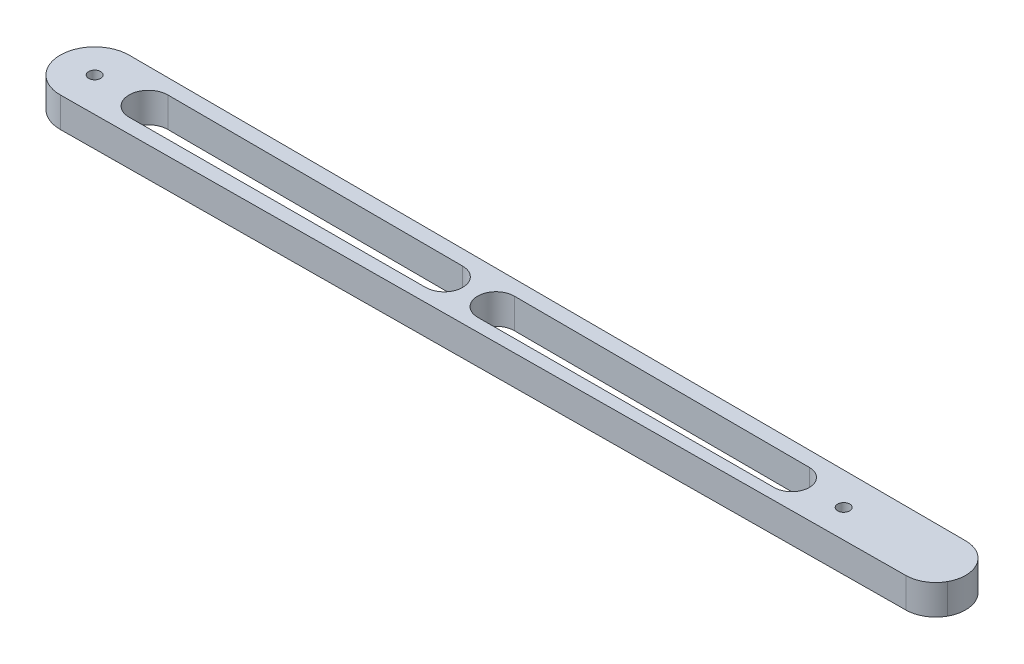
ISO-10303-21;
HEADER;
FILE_DESCRIPTION(('STEP AP214'),'2;1');
FILE_NAME('part.step','',(''),(''),'','','');
FILE_SCHEMA(('AUTOMOTIVE_DESIGN { 1 0 10303 214 1 1 1 1 }'));
ENDSEC;
DATA;
#1=APPLICATION_CONTEXT('core data for automotive mechanical design processes');
#2=APPLICATION_PROTOCOL_DEFINITION('international standard','automotive_design',2000,#1);
#3=PRODUCT_CONTEXT('',#1,'mechanical');
#4=PRODUCT('Part','Part','',(#3));
#5=PRODUCT_RELATED_PRODUCT_CATEGORY('part','',(#4));
#6=PRODUCT_DEFINITION_FORMATION('','',#4);
#7=PRODUCT_DEFINITION_CONTEXT('part definition',#1,'design');
#8=PRODUCT_DEFINITION('design','',#6,#7);
#9=PRODUCT_DEFINITION_SHAPE('','',#8);
#10=(LENGTH_UNIT() NAMED_UNIT(*) SI_UNIT(.MILLI.,.METRE.));
#11=(NAMED_UNIT(*) PLANE_ANGLE_UNIT() SI_UNIT($,.RADIAN.));
#12=(NAMED_UNIT(*) SI_UNIT($,.STERADIAN.) SOLID_ANGLE_UNIT());
#13=UNCERTAINTY_MEASURE_WITH_UNIT(LENGTH_MEASURE(1.E-05),#10,'distance_accuracy_value','');
#14=(GEOMETRIC_REPRESENTATION_CONTEXT(3) GLOBAL_UNCERTAINTY_ASSIGNED_CONTEXT((#13)) GLOBAL_UNIT_ASSIGNED_CONTEXT((#10,
#11,#12)) REPRESENTATION_CONTEXT('',''));
#15=CARTESIAN_POINT('',(0.,0.,0.));
#16=DIRECTION('',(0.,0.,1.));
#17=DIRECTION('',(1.,0.,0.));
#18=AXIS2_PLACEMENT_3D('',#15,#16,#17);
#19=CARTESIAN_POINT('',(279.991516646627,10.,-0.713392763578785));
#20=DIRECTION('',(0.,-1.,0.));
#21=DIRECTION('',(0.,0.,-1.));
#22=AXIS2_PLACEMENT_3D('',#19,#20,#21);
#23=CYLINDRICAL_SURFACE('',#22,10.);
#24=DIRECTION('',(0.,-1.,0.));
#25=VECTOR('',#24,1.);
#26=CARTESIAN_POINT('',(288.751175374613,10.,4.11033805076096));
#27=LINE('',#26,#25);
#28=CARTESIAN_POINT('',(288.751175374613,10.,4.11033805076096));
#29=VERTEX_POINT('',#28);
#30=CARTESIAN_POINT('',(288.751175374613,0.,4.11033805076096));
#31=VERTEX_POINT('',#30);
#32=EDGE_CURVE('E11',#29,#31,#27,.T.);
#33=ORIENTED_EDGE('',*,*,#32,.F.);
#34=CARTESIAN_POINT('',(279.991516646627,10.,-0.713392763578785));
#35=DIRECTION('',(0.,1.,0.));
#36=DIRECTION('',(0.,0.,1.));
#37=AXIS2_PLACEMENT_3D('',#34,#35,#36);
#38=CIRCLE('',#37,10.);
#39=CARTESIAN_POINT('',(280.070567987159,10.,9.28629477581763));
#40=VERTEX_POINT('',#39);
#41=EDGE_CURVE('E224',#40,#29,#38,.T.);
#42=ORIENTED_EDGE('',*,*,#41,.F.);
#43=DIRECTION('',(0.,-1.,0.));
#44=VECTOR('',#43,1.);
#45=CARTESIAN_POINT('',(280.070567987159,10.,9.28629477581763));
#46=LINE('',#45,#44);
#47=CARTESIAN_POINT('',(280.070567987159,0.,9.28629477581763));
#48=VERTEX_POINT('',#47);
#49=EDGE_CURVE('E243',#40,#48,#46,.T.);
#50=ORIENTED_EDGE('',*,*,#49,.T.);
#51=CARTESIAN_POINT('',(279.991516646627,0.,-0.713392763578785));
#52=DIRECTION('',(0.,1.,0.));
#53=DIRECTION('',(0.,0.,1.));
#54=AXIS2_PLACEMENT_3D('',#51,#52,#53);
#55=CIRCLE('',#54,10.);
#56=EDGE_CURVE('E235',#48,#31,#55,.T.);
#57=ORIENTED_EDGE('',*,*,#56,.T.);
#58=EDGE_LOOP('',(#33,#42,#50,#57));
#59=FACE_BOUND('',#58,.T.);
#60=ADVANCED_FACE('F36',(#59),#23,.T.);
#61=CARTESIAN_POINT('',(0.,10.,0.));
#62=DIRECTION('',(0.,1.,0.));
#63=DIRECTION('',(0.,0.,1.));
#64=AXIS2_PLACEMENT_3D('',#61,#62,#63);
#65=PLANE('',#64);
#66=CARTESIAN_POINT('',(116.65361864242,10.,0.));
#67=DIRECTION('',(0.,1.,0.));
#68=DIRECTION('',(0.,0.,1.));
#69=AXIS2_PLACEMENT_3D('',#66,#67,#68);
#70=CIRCLE('',#69,6.17227253848298);
#71=CARTESIAN_POINT('',(116.670959066441,10.,6.17224818028293));
#72=VERTEX_POINT('',#71);
#73=CARTESIAN_POINT('',(116.670959066441,10.,-6.17224818028293));
#74=VERTEX_POINT('',#73);
#75=EDGE_CURVE('E136',#72,#74,#70,.T.);
#76=ORIENTED_EDGE('',*,*,#75,.F.);
#77=DIRECTION('',(0.99999605360912,0.,-0.00280940673192141));
#78=VECTOR('',#77,1.);
#79=CARTESIAN_POINT('',(17.9676918225829,10.,6.44954689806959));
#80=LINE('',#79,#78);
#81=CARTESIAN_POINT('',(17.9676918225829,10.,6.44954689806959));
#82=VERTEX_POINT('',#81);
#83=EDGE_CURVE('E154',#82,#72,#80,.T.);
#84=ORIENTED_EDGE('',*,*,#83,.F.);
#85=CARTESIAN_POINT('',(17.9495723506031,10.,0.));
#86=DIRECTION('',(0.,1.,0.));
#87=DIRECTION('',(0.,0.,1.));
#88=AXIS2_PLACEMENT_3D('',#85,#86,#87);
#89=CIRCLE('',#88,6.4495723506031);
#90=CARTESIAN_POINT('',(17.9676918225829,10.,-6.44954689806959));
#91=VERTEX_POINT('',#90);
#92=EDGE_CURVE('E157',#91,#82,#89,.T.);
#93=ORIENTED_EDGE('',*,*,#92,.F.);
#94=DIRECTION('',(-0.99999605360912,0.,-0.00280940673192141));
#95=VECTOR('',#94,1.);
#96=CARTESIAN_POINT('',(17.9676918225829,10.,-6.44954689806959));
#97=LINE('',#96,#95);
#98=EDGE_CURVE('E163',#74,#91,#97,.T.);
#99=ORIENTED_EDGE('',*,*,#98,.F.);
#100=EDGE_LOOP('',(#76,#84,#93,#99));
#101=FACE_BOUND('',#100,.T.);
#102=CARTESIAN_POINT('',(133.949572350603,10.,0.));
#103=DIRECTION('',(0.,1.,0.));
#104=DIRECTION('',(0.,0.,1.));
#105=AXIS2_PLACEMENT_3D('',#102,#103,#104);
#106=CIRCLE('',#105,6.12368116970022);
#107=CARTESIAN_POINT('',(133.966776261705,10.,-6.1236570032607));
#108=VERTEX_POINT('',#107);
#109=CARTESIAN_POINT('',(133.966776261705,10.,6.1236570032607));
#110=VERTEX_POINT('',#109);
#111=EDGE_CURVE('E188',#108,#110,#106,.T.);
#112=ORIENTED_EDGE('',*,*,#111,.F.);
#113=DIRECTION('',(-0.99999605360912,0.,-0.00280940673192142));
#114=VECTOR('',#113,1.);
#115=CARTESIAN_POINT('',(133.966776261705,10.,-6.1236570032607));
#116=LINE('',#115,#114);
#117=CARTESIAN_POINT('',(232.670043505563,10.,-5.84635828547403));
#118=VERTEX_POINT('',#117);
#119=EDGE_CURVE('E178',#118,#108,#116,.T.);
#120=ORIENTED_EDGE('',*,*,#119,.F.);
#121=CARTESIAN_POINT('',(232.65361864242,10.,0.));
#122=DIRECTION('',(0.,1.,0.));
#123=DIRECTION('',(0.,0.,1.));
#124=AXIS2_PLACEMENT_3D('',#121,#122,#123);
#125=CIRCLE('',#124,5.8463813575801);
#126=CARTESIAN_POINT('',(232.670043505563,10.,5.84635828547403));
#127=VERTEX_POINT('',#126);
#128=EDGE_CURVE('E193',#127,#118,#125,.T.);
#129=ORIENTED_EDGE('',*,*,#128,.F.);
#130=DIRECTION('',(0.99999605360912,0.,-0.00280940673192142));
#131=VECTOR('',#130,1.);
#132=CARTESIAN_POINT('',(133.966776261705,10.,6.1236570032607));
#133=LINE('',#132,#131);
#134=EDGE_CURVE('E190',#110,#127,#133,.T.);
#135=ORIENTED_EDGE('',*,*,#134,.F.);
#136=EDGE_LOOP('',(#112,#120,#129,#135));
#137=FACE_BOUND('',#136,.T.);
#138=CARTESIAN_POINT('',(250.,10.,0.));
#139=DIRECTION('',(0.,1.,0.));
#140=DIRECTION('',(0.,0.,1.));
#141=AXIS2_PLACEMENT_3D('',#138,#139,#140);
#142=CIRCLE('',#141,2.);
#143=CARTESIAN_POINT('',(250.,10.,2.));
#144=VERTEX_POINT('',#143);
#145=EDGE_CURVE('E211',#144,#144,#142,.T.);
#146=ORIENTED_EDGE('',*,*,#145,.F.);
#147=EDGE_LOOP('',(#146));
#148=FACE_BOUND('',#147,.T.);
#149=CARTESIAN_POINT('',(0.,10.,0.));
#150=DIRECTION('',(0.,1.,0.));
#151=DIRECTION('',(0.,0.,1.));
#152=AXIS2_PLACEMENT_3D('',#149,#150,#151);
#153=CIRCLE('',#152,11.5);
#154=CARTESIAN_POINT('',(0.032308177417096,10.,-11.4999546165049));
#155=VERTEX_POINT('',#154);
#156=CARTESIAN_POINT('',(0.0909090416124194,10.,11.4996406703059));
#157=VERTEX_POINT('',#156);
#158=EDGE_CURVE('E217',#155,#157,#153,.T.);
#159=ORIENTED_EDGE('',*,*,#158,.T.);
#160=DIRECTION('',(0.999968753939642,0.,-0.00790513405325384));
#161=VECTOR('',#160,1.);
#162=CARTESIAN_POINT('',(0.0909090416124194,10.,11.4996406703059));
#163=LINE('',#162,#161);
#164=EDGE_CURVE('E220',#157,#40,#163,.T.);
#165=ORIENTED_EDGE('',*,*,#164,.T.);
#166=ORIENTED_EDGE('',*,*,#41,.T.);
#167=CARTESIAN_POINT('',(280.019610713946,10.,-10.71335329967));
#168=VERTEX_POINT('',#167);
#169=EDGE_CURVE('E223',#29,#168,#38,.T.);
#170=ORIENTED_EDGE('',*,*,#169,.T.);
#171=DIRECTION('',(-0.99999605360912,0.,-0.00280940673192137));
#172=VECTOR('',#171,1.);
#173=CARTESIAN_POINT('',(280.019610713946,10.,-10.71335329967));
#174=LINE('',#173,#172);
#175=EDGE_CURVE('E227',#168,#155,#174,.T.);
#176=ORIENTED_EDGE('',*,*,#175,.T.);
#177=EDGE_LOOP('',(#159,#165,#166,#170,#176));
#178=FACE_BOUND('',#177,.T.);
#179=CARTESIAN_POINT('',(0.,10.,0.));
#180=DIRECTION('',(0.,1.,0.));
#181=DIRECTION('',(0.,0.,1.));
#182=AXIS2_PLACEMENT_3D('',#179,#180,#181);
#183=CIRCLE('',#182,2.);
#184=CARTESIAN_POINT('',(0.,10.,2.));
#185=VERTEX_POINT('',#184);
#186=EDGE_CURVE('E205',#185,#185,#183,.T.);
#187=ORIENTED_EDGE('',*,*,#186,.F.);
#188=EDGE_LOOP('',(#187));
#189=FACE_BOUND('',#188,.T.);
#190=ADVANCED_FACE('F259',(#101,#137,#148,#178,#189),#65,.T.);
#191=CARTESIAN_POINT('',(0.,0.,0.));
#192=DIRECTION('',(0.,1.,0.));
#193=DIRECTION('',(0.,0.,1.));
#194=AXIS2_PLACEMENT_3D('',#191,#192,#193);
#195=PLANE('',#194);
#196=DIRECTION('',(0.99999605360912,0.,-0.00280940673192141));
#197=VECTOR('',#196,1.);
#198=CARTESIAN_POINT('',(17.9676918225829,0.,6.44954689806959));
#199=LINE('',#198,#197);
#200=CARTESIAN_POINT('',(17.9676918225829,0.,6.44954689806959));
#201=VERTEX_POINT('',#200);
#202=CARTESIAN_POINT('',(116.670959066441,0.,6.17224818028293));
#203=VERTEX_POINT('',#202);
#204=EDGE_CURVE('E141',#201,#203,#199,.T.);
#205=ORIENTED_EDGE('',*,*,#204,.T.);
#206=CARTESIAN_POINT('',(116.65361864242,0.,0.));
#207=DIRECTION('',(0.,1.,0.));
#208=DIRECTION('',(0.,0.,1.));
#209=AXIS2_PLACEMENT_3D('',#206,#207,#208);
#210=CIRCLE('',#209,6.17227253848298);
#211=CARTESIAN_POINT('',(116.670959066441,0.,-6.17224818028293));
#212=VERTEX_POINT('',#211);
#213=EDGE_CURVE('E133',#203,#212,#210,.T.);
#214=ORIENTED_EDGE('',*,*,#213,.T.);
#215=DIRECTION('',(-0.99999605360912,0.,-0.00280940673192141));
#216=VECTOR('',#215,1.);
#217=CARTESIAN_POINT('',(17.9676918225829,0.,-6.44954689806959));
#218=LINE('',#217,#216);
#219=CARTESIAN_POINT('',(17.9676918225829,0.,-6.44954689806959));
#220=VERTEX_POINT('',#219);
#221=EDGE_CURVE('E145',#212,#220,#218,.T.);
#222=ORIENTED_EDGE('',*,*,#221,.T.);
#223=CARTESIAN_POINT('',(17.9495723506031,0.,0.));
#224=DIRECTION('',(0.,1.,0.));
#225=DIRECTION('',(0.,0.,1.));
#226=AXIS2_PLACEMENT_3D('',#223,#224,#225);
#227=CIRCLE('',#226,6.4495723506031);
#228=EDGE_CURVE('E149',#220,#201,#227,.T.);
#229=ORIENTED_EDGE('',*,*,#228,.T.);
#230=EDGE_LOOP('',(#205,#214,#222,#229));
#231=FACE_BOUND('',#230,.T.);
#232=DIRECTION('',(-0.99999605360912,0.,-0.00280940673192142));
#233=VECTOR('',#232,1.);
#234=CARTESIAN_POINT('',(133.966776261705,0.,-6.1236570032607));
#235=LINE('',#234,#233);
#236=CARTESIAN_POINT('',(232.670043505563,0.,-5.84635828547403));
#237=VERTEX_POINT('',#236);
#238=CARTESIAN_POINT('',(133.966776261705,0.,-6.1236570032607));
#239=VERTEX_POINT('',#238);
#240=EDGE_CURVE('E184',#237,#239,#235,.T.);
#241=ORIENTED_EDGE('',*,*,#240,.T.);
#242=CARTESIAN_POINT('',(133.949572350603,0.,0.));
#243=DIRECTION('',(0.,1.,0.));
#244=DIRECTION('',(0.,0.,1.));
#245=AXIS2_PLACEMENT_3D('',#242,#243,#244);
#246=CIRCLE('',#245,6.12368116970022);
#247=CARTESIAN_POINT('',(133.966776261705,0.,6.1236570032607));
#248=VERTEX_POINT('',#247);
#249=EDGE_CURVE('E174',#239,#248,#246,.T.);
#250=ORIENTED_EDGE('',*,*,#249,.T.);
#251=DIRECTION('',(0.99999605360912,0.,-0.00280940673192142));
#252=VECTOR('',#251,1.);
#253=CARTESIAN_POINT('',(133.966776261705,0.,6.1236570032607));
#254=LINE('',#253,#252);
#255=CARTESIAN_POINT('',(232.670043505563,0.,5.84635828547403));
#256=VERTEX_POINT('',#255);
#257=EDGE_CURVE('E177',#248,#256,#254,.T.);
#258=ORIENTED_EDGE('',*,*,#257,.T.);
#259=CARTESIAN_POINT('',(232.65361864242,0.,0.));
#260=DIRECTION('',(0.,1.,0.));
#261=DIRECTION('',(0.,0.,1.));
#262=AXIS2_PLACEMENT_3D('',#259,#260,#261);
#263=CIRCLE('',#262,5.8463813575801);
#264=EDGE_CURVE('E181',#256,#237,#263,.T.);
#265=ORIENTED_EDGE('',*,*,#264,.T.);
#266=EDGE_LOOP('',(#241,#250,#258,#265));
#267=FACE_BOUND('',#266,.T.);
#268=CARTESIAN_POINT('',(0.,0.,0.));
#269=DIRECTION('',(0.,1.,0.));
#270=DIRECTION('',(0.,0.,1.));
#271=AXIS2_PLACEMENT_3D('',#268,#269,#270);
#272=CIRCLE('',#271,11.5);
#273=CARTESIAN_POINT('',(0.032308177417096,0.,-11.4999546165049));
#274=VERTEX_POINT('',#273);
#275=CARTESIAN_POINT('',(0.0909090416124194,0.,11.4996406703059));
#276=VERTEX_POINT('',#275);
#277=EDGE_CURVE('E214',#274,#276,#272,.T.);
#278=ORIENTED_EDGE('',*,*,#277,.F.);
#279=DIRECTION('',(-0.99999605360912,0.,-0.00280940673192137));
#280=VECTOR('',#279,1.);
#281=CARTESIAN_POINT('',(280.019610713946,0.,-10.71335329967));
#282=LINE('',#281,#280);
#283=CARTESIAN_POINT('',(280.019610713946,0.,-10.71335329967));
#284=VERTEX_POINT('',#283);
#285=EDGE_CURVE('E221',#284,#274,#282,.T.);
#286=ORIENTED_EDGE('',*,*,#285,.F.);
#287=EDGE_CURVE('E234',#31,#284,#55,.T.);
#288=ORIENTED_EDGE('',*,*,#287,.F.);
#289=ORIENTED_EDGE('',*,*,#56,.F.);
#290=DIRECTION('',(0.999968753939642,0.,-0.00790513405325384));
#291=VECTOR('',#290,1.);
#292=CARTESIAN_POINT('',(0.0909090416124194,0.,11.4996406703059));
#293=LINE('',#292,#291);
#294=EDGE_CURVE('E232',#276,#48,#293,.T.);
#295=ORIENTED_EDGE('',*,*,#294,.F.);
#296=EDGE_LOOP('',(#278,#286,#288,#289,#295));
#297=FACE_BOUND('',#296,.T.);
#298=CARTESIAN_POINT('',(250.,0.,0.));
#299=DIRECTION('',(0.,1.,0.));
#300=DIRECTION('',(0.,0.,1.));
#301=AXIS2_PLACEMENT_3D('',#298,#299,#300);
#302=CIRCLE('',#301,2.);
#303=CARTESIAN_POINT('',(250.,0.,2.));
#304=VERTEX_POINT('',#303);
#305=EDGE_CURVE('E208',#304,#304,#302,.T.);
#306=ORIENTED_EDGE('',*,*,#305,.T.);
#307=EDGE_LOOP('',(#306));
#308=FACE_BOUND('',#307,.T.);
#309=CARTESIAN_POINT('',(0.,0.,0.));
#310=DIRECTION('',(0.,1.,0.));
#311=DIRECTION('',(0.,0.,1.));
#312=AXIS2_PLACEMENT_3D('',#309,#310,#311);
#313=CIRCLE('',#312,2.);
#314=CARTESIAN_POINT('',(0.,0.,2.));
#315=VERTEX_POINT('',#314);
#316=EDGE_CURVE('E170',#315,#315,#313,.T.);
#317=ORIENTED_EDGE('',*,*,#316,.T.);
#318=EDGE_LOOP('',(#317));
#319=FACE_BOUND('',#318,.T.);
#320=ADVANCED_FACE('F151',(#231,#267,#297,#308,#319),#195,.F.);
#321=CARTESIAN_POINT('',(0.,10.,0.));
#322=DIRECTION('',(0.,-1.,0.));
#323=DIRECTION('',(0.,0.,-1.));
#324=AXIS2_PLACEMENT_3D('',#321,#322,#323);
#325=CYLINDRICAL_SURFACE('',#324,11.5);
#326=ORIENTED_EDGE('',*,*,#277,.T.);
#327=DIRECTION('',(0.,-1.,0.));
#328=VECTOR('',#327,1.);
#329=CARTESIAN_POINT('',(0.0909090416124194,10.,11.4996406703059));
#330=LINE('',#329,#328);
#331=EDGE_CURVE('E45',#157,#276,#330,.T.);
#332=ORIENTED_EDGE('',*,*,#331,.F.);
#333=ORIENTED_EDGE('',*,*,#158,.F.);
#334=DIRECTION('',(0.,-1.,0.));
#335=VECTOR('',#334,1.);
#336=CARTESIAN_POINT('',(0.032308177417096,10.,-11.4999546165049));
#337=LINE('',#336,#335);
#338=EDGE_CURVE('E229',#155,#274,#337,.T.);
#339=ORIENTED_EDGE('',*,*,#338,.T.);
#340=EDGE_LOOP('',(#326,#332,#333,#339));
#341=FACE_BOUND('',#340,.T.);
#342=ADVANCED_FACE('F38',(#341),#325,.T.);
#343=CARTESIAN_POINT('',(0.0909090416124194,10.,11.4996406703059));
#344=DIRECTION('',(-0.00790513405325384,0.,-0.999968753939642));
#345=DIRECTION('',(-0.999968753939642,0.,0.00790513405325384));
#346=AXIS2_PLACEMENT_3D('',#343,#344,#345);
#347=PLANE('',#346);
#348=ORIENTED_EDGE('',*,*,#294,.T.);
#349=ORIENTED_EDGE('',*,*,#49,.F.);
#350=ORIENTED_EDGE('',*,*,#164,.F.);
#351=ORIENTED_EDGE('',*,*,#331,.T.);
#352=EDGE_LOOP('',(#348,#349,#350,#351));
#353=FACE_BOUND('',#352,.T.);
#354=ADVANCED_FACE('F248',(#353),#347,.F.);
#355=ORIENTED_EDGE('',*,*,#169,.F.);
#356=ORIENTED_EDGE('',*,*,#32,.T.);
#357=ORIENTED_EDGE('',*,*,#287,.T.);
#358=DIRECTION('',(0.,-1.,0.));
#359=VECTOR('',#358,1.);
#360=CARTESIAN_POINT('',(280.019610713946,10.,-10.71335329967));
#361=LINE('',#360,#359);
#362=EDGE_CURVE('E240',#168,#284,#361,.T.);
#363=ORIENTED_EDGE('',*,*,#362,.F.);
#364=EDGE_LOOP('',(#355,#356,#357,#363));
#365=FACE_BOUND('',#364,.T.);
#366=ADVANCED_FACE('F265',(#365),#23,.T.);
#367=CARTESIAN_POINT('',(280.019610713946,10.,-10.71335329967));
#368=DIRECTION('',(-0.00280940673192137,0.,0.99999605360912));
#369=DIRECTION('',(0.99999605360912,0.,0.00280940673192137));
#370=AXIS2_PLACEMENT_3D('',#367,#368,#369);
#371=PLANE('',#370);
#372=ORIENTED_EDGE('',*,*,#285,.T.);
#373=ORIENTED_EDGE('',*,*,#338,.F.);
#374=ORIENTED_EDGE('',*,*,#175,.F.);
#375=ORIENTED_EDGE('',*,*,#362,.T.);
#376=EDGE_LOOP('',(#372,#373,#374,#375));
#377=FACE_BOUND('',#376,.T.);
#378=ADVANCED_FACE('F264',(#377),#371,.F.);
#379=CARTESIAN_POINT('',(250.,10.,0.));
#380=DIRECTION('',(0.,-1.,0.));
#381=DIRECTION('',(0.,0.,-1.));
#382=AXIS2_PLACEMENT_3D('',#379,#380,#381);
#383=CYLINDRICAL_SURFACE('',#382,2.);
#384=ORIENTED_EDGE('',*,*,#145,.T.);
#385=EDGE_LOOP('',(#384));
#386=FACE_BOUND('',#385,.T.);
#387=ORIENTED_EDGE('',*,*,#305,.F.);
#388=EDGE_LOOP('',(#387));
#389=FACE_BOUND('',#388,.T.);
#390=ADVANCED_FACE('F272',(#386,#389),#383,.F.);
#391=CARTESIAN_POINT('',(0.,10.,0.));
#392=DIRECTION('',(0.,-1.,0.));
#393=DIRECTION('',(0.,0.,-1.));
#394=AXIS2_PLACEMENT_3D('',#391,#392,#393);
#395=CYLINDRICAL_SURFACE('',#394,2.);
#396=ORIENTED_EDGE('',*,*,#186,.T.);
#397=EDGE_LOOP('',(#396));
#398=FACE_BOUND('',#397,.T.);
#399=ORIENTED_EDGE('',*,*,#316,.F.);
#400=EDGE_LOOP('',(#399));
#401=FACE_BOUND('',#400,.T.);
#402=ADVANCED_FACE('F288',(#398,#401),#395,.F.);
#403=CARTESIAN_POINT('',(133.949572350603,0.,0.));
#404=DIRECTION('',(0.,1.,0.));
#405=DIRECTION('',(0.,0.,1.));
#406=AXIS2_PLACEMENT_3D('',#403,#404,#405);
#407=CYLINDRICAL_SURFACE('',#406,6.12368116970022);
#408=ORIENTED_EDGE('',*,*,#111,.T.);
#409=DIRECTION('',(0.,1.,0.));
#410=VECTOR('',#409,1.);
#411=CARTESIAN_POINT('',(133.966776261705,0.,6.1236570032607));
#412=LINE('',#411,#410);
#413=EDGE_CURVE('E187',#248,#110,#412,.T.);
#414=ORIENTED_EDGE('',*,*,#413,.F.);
#415=ORIENTED_EDGE('',*,*,#249,.F.);
#416=DIRECTION('',(0.,1.,0.));
#417=VECTOR('',#416,1.);
#418=CARTESIAN_POINT('',(133.966776261705,0.,-6.1236570032607));
#419=LINE('',#418,#417);
#420=EDGE_CURVE('E164',#239,#108,#419,.T.);
#421=ORIENTED_EDGE('',*,*,#420,.T.);
#422=EDGE_LOOP('',(#408,#414,#415,#421));
#423=FACE_BOUND('',#422,.T.);
#424=ADVANCED_FACE('F292',(#423),#407,.F.);
#425=CARTESIAN_POINT('',(133.966776261705,0.,-6.1236570032607));
#426=DIRECTION('',(0.00280940673192142,0.,-0.99999605360912));
#427=DIRECTION('',(-0.99999605360912,0.,-0.00280940673192142));
#428=AXIS2_PLACEMENT_3D('',#425,#426,#427);
#429=PLANE('',#428);
#430=ORIENTED_EDGE('',*,*,#119,.T.);
#431=ORIENTED_EDGE('',*,*,#420,.F.);
#432=ORIENTED_EDGE('',*,*,#240,.F.);
#433=DIRECTION('',(0.,1.,0.));
#434=VECTOR('',#433,1.);
#435=CARTESIAN_POINT('',(232.670043505563,0.,-5.84635828547403));
#436=LINE('',#435,#434);
#437=EDGE_CURVE('E199',#237,#118,#436,.T.);
#438=ORIENTED_EDGE('',*,*,#437,.T.);
#439=EDGE_LOOP('',(#430,#431,#432,#438));
#440=FACE_BOUND('',#439,.T.);
#441=ADVANCED_FACE('F296',(#440),#429,.F.);
#442=CARTESIAN_POINT('',(232.65361864242,0.,0.));
#443=DIRECTION('',(0.,1.,0.));
#444=DIRECTION('',(0.,0.,1.));
#445=AXIS2_PLACEMENT_3D('',#442,#443,#444);
#446=CYLINDRICAL_SURFACE('',#445,5.8463813575801);
#447=ORIENTED_EDGE('',*,*,#128,.T.);
#448=ORIENTED_EDGE('',*,*,#437,.F.);
#449=ORIENTED_EDGE('',*,*,#264,.F.);
#450=DIRECTION('',(0.,1.,0.));
#451=VECTOR('',#450,1.);
#452=CARTESIAN_POINT('',(232.670043505563,0.,5.84635828547403));
#453=LINE('',#452,#451);
#454=EDGE_CURVE('E201',#256,#127,#453,.T.);
#455=ORIENTED_EDGE('',*,*,#454,.T.);
#456=EDGE_LOOP('',(#447,#448,#449,#455));
#457=FACE_BOUND('',#456,.T.);
#458=ADVANCED_FACE('F301',(#457),#446,.F.);
#459=CARTESIAN_POINT('',(133.966776261705,0.,6.1236570032607));
#460=DIRECTION('',(0.00280940673192142,0.,0.99999605360912));
#461=DIRECTION('',(0.99999605360912,0.,-0.00280940673192142));
#462=AXIS2_PLACEMENT_3D('',#459,#460,#461);
#463=PLANE('',#462);
#464=ORIENTED_EDGE('',*,*,#134,.T.);
#465=ORIENTED_EDGE('',*,*,#454,.F.);
#466=ORIENTED_EDGE('',*,*,#257,.F.);
#467=ORIENTED_EDGE('',*,*,#413,.T.);
#468=EDGE_LOOP('',(#464,#465,#466,#467));
#469=FACE_BOUND('',#468,.T.);
#470=ADVANCED_FACE('F298',(#469),#463,.F.);
#471=CARTESIAN_POINT('',(116.65361864242,0.,0.));
#472=DIRECTION('',(0.,1.,0.));
#473=DIRECTION('',(0.,0.,1.));
#474=AXIS2_PLACEMENT_3D('',#471,#472,#473);
#475=CYLINDRICAL_SURFACE('',#474,6.17227253848298);
#476=ORIENTED_EDGE('',*,*,#75,.T.);
#477=DIRECTION('',(0.,1.,0.));
#478=VECTOR('',#477,1.);
#479=CARTESIAN_POINT('',(116.670959066441,0.,-6.17224818028293));
#480=LINE('',#479,#478);
#481=EDGE_CURVE('E129',#212,#74,#480,.T.);
#482=ORIENTED_EDGE('',*,*,#481,.F.);
#483=ORIENTED_EDGE('',*,*,#213,.F.);
#484=DIRECTION('',(0.,1.,0.));
#485=VECTOR('',#484,1.);
#486=CARTESIAN_POINT('',(116.670959066441,0.,6.17224818028293));
#487=LINE('',#486,#485);
#488=EDGE_CURVE('E168',#203,#72,#487,.T.);
#489=ORIENTED_EDGE('',*,*,#488,.T.);
#490=EDGE_LOOP('',(#476,#482,#483,#489));
#491=FACE_BOUND('',#490,.T.);
#492=ADVANCED_FACE('F131',(#491),#475,.F.);
#493=CARTESIAN_POINT('',(17.9676918225829,0.,6.44954689806959));
#494=DIRECTION('',(0.00280940673192141,0.,0.99999605360912));
#495=DIRECTION('',(0.99999605360912,0.,-0.00280940673192141));
#496=AXIS2_PLACEMENT_3D('',#493,#494,#495);
#497=PLANE('',#496);
#498=ORIENTED_EDGE('',*,*,#83,.T.);
#499=ORIENTED_EDGE('',*,*,#488,.F.);
#500=ORIENTED_EDGE('',*,*,#204,.F.);
#501=DIRECTION('',(0.,1.,0.));
#502=VECTOR('',#501,1.);
#503=CARTESIAN_POINT('',(17.9676918225829,0.,6.44954689806959));
#504=LINE('',#503,#502);
#505=EDGE_CURVE('E171',#201,#82,#504,.T.);
#506=ORIENTED_EDGE('',*,*,#505,.T.);
#507=EDGE_LOOP('',(#498,#499,#500,#506));
#508=FACE_BOUND('',#507,.T.);
#509=ADVANCED_FACE('F311',(#508),#497,.F.);
#510=CARTESIAN_POINT('',(17.9495723506031,0.,0.));
#511=DIRECTION('',(0.,1.,0.));
#512=DIRECTION('',(0.,0.,1.));
#513=AXIS2_PLACEMENT_3D('',#510,#511,#512);
#514=CYLINDRICAL_SURFACE('',#513,6.4495723506031);
#515=ORIENTED_EDGE('',*,*,#92,.T.);
#516=ORIENTED_EDGE('',*,*,#505,.F.);
#517=ORIENTED_EDGE('',*,*,#228,.F.);
#518=DIRECTION('',(0.,1.,0.));
#519=VECTOR('',#518,1.);
#520=CARTESIAN_POINT('',(17.9676918225829,0.,-6.44954689806959));
#521=LINE('',#520,#519);
#522=EDGE_CURVE('E140',#220,#91,#521,.T.);
#523=ORIENTED_EDGE('',*,*,#522,.T.);
#524=EDGE_LOOP('',(#515,#516,#517,#523));
#525=FACE_BOUND('',#524,.T.);
#526=ADVANCED_FACE('F314',(#525),#514,.F.);
#527=CARTESIAN_POINT('',(17.9676918225829,0.,-6.44954689806959));
#528=DIRECTION('',(0.00280940673192141,0.,-0.99999605360912));
#529=DIRECTION('',(-0.99999605360912,0.,-0.00280940673192141));
#530=AXIS2_PLACEMENT_3D('',#527,#528,#529);
#531=PLANE('',#530);
#532=ORIENTED_EDGE('',*,*,#98,.T.);
#533=ORIENTED_EDGE('',*,*,#522,.F.);
#534=ORIENTED_EDGE('',*,*,#221,.F.);
#535=ORIENTED_EDGE('',*,*,#481,.T.);
#536=EDGE_LOOP('',(#532,#533,#534,#535));
#537=FACE_BOUND('',#536,.T.);
#538=ADVANCED_FACE('F146',(#537),#531,.F.);
#539=CLOSED_SHELL('',(#60,#190,#320,#342,#354,#366,#378,#390,#402,#424,#441,#458,#470,#492,#509,
#526,#538));
#540=MANIFOLD_SOLID_BREP('B2',#539);
#541=ADVANCED_BREP_SHAPE_REPRESENTATION('',(#18,#540),#14);
#542=SHAPE_DEFINITION_REPRESENTATION(#9,#541);
ENDSEC;
END-ISO-10303-21;
